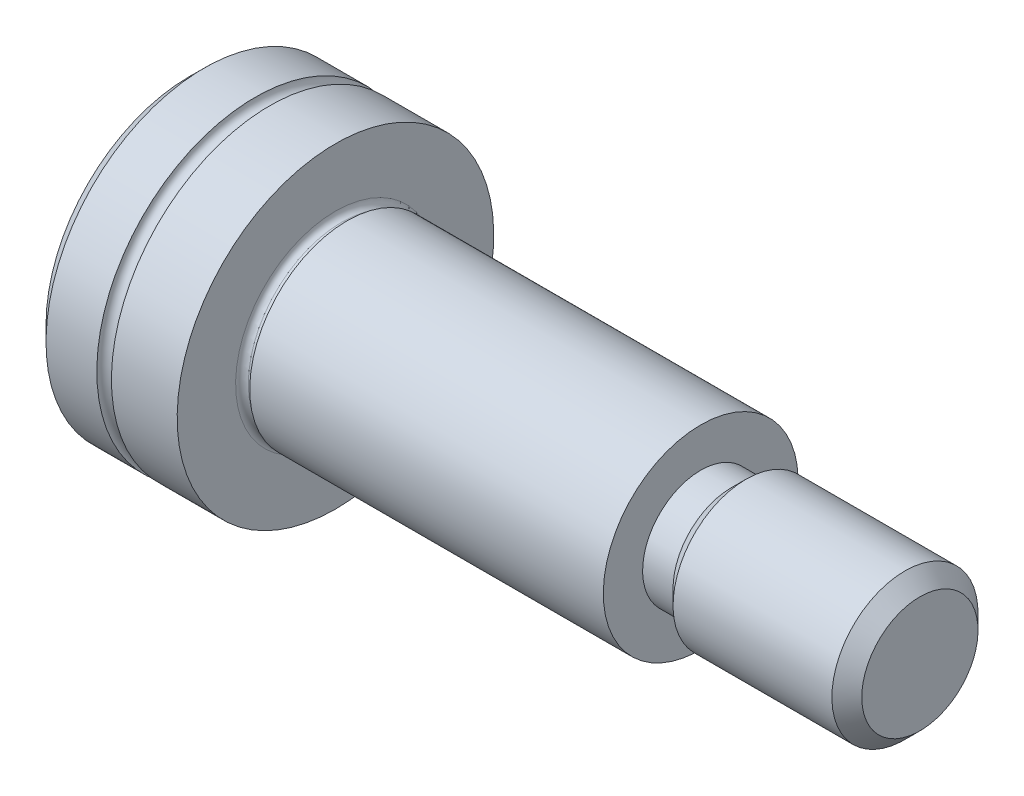
ISO-10303-21;
HEADER;
FILE_DESCRIPTION(('STEP AP214'),'2;1');
FILE_NAME('part.step','',(''),(''),'','','');
FILE_SCHEMA(('AUTOMOTIVE_DESIGN { 1 0 10303 214 1 1 1 1 }'));
ENDSEC;
DATA;
#1=APPLICATION_CONTEXT('core data for automotive mechanical design processes');
#2=APPLICATION_PROTOCOL_DEFINITION('international standard','automotive_design',2000,#1);
#3=PRODUCT_CONTEXT('',#1,'mechanical');
#4=PRODUCT('Part','Part','',(#3));
#5=PRODUCT_RELATED_PRODUCT_CATEGORY('part','',(#4));
#6=PRODUCT_DEFINITION_FORMATION('','',#4);
#7=PRODUCT_DEFINITION_CONTEXT('part definition',#1,'design');
#8=PRODUCT_DEFINITION('design','',#6,#7);
#9=PRODUCT_DEFINITION_SHAPE('','',#8);
#10=(LENGTH_UNIT() NAMED_UNIT(*) SI_UNIT(.MILLI.,.METRE.));
#11=(NAMED_UNIT(*) PLANE_ANGLE_UNIT() SI_UNIT($,.RADIAN.));
#12=(NAMED_UNIT(*) SI_UNIT($,.STERADIAN.) SOLID_ANGLE_UNIT());
#13=UNCERTAINTY_MEASURE_WITH_UNIT(LENGTH_MEASURE(1.E-05),#10,'distance_accuracy_value','');
#14=(GEOMETRIC_REPRESENTATION_CONTEXT(3) GLOBAL_UNCERTAINTY_ASSIGNED_CONTEXT((#13)) GLOBAL_UNIT_ASSIGNED_CONTEXT((#10,
#11,#12)) REPRESENTATION_CONTEXT('',''));
#15=CARTESIAN_POINT('',(0.,0.,0.));
#16=DIRECTION('',(0.,0.,1.));
#17=DIRECTION('',(1.,0.,0.));
#18=AXIS2_PLACEMENT_3D('',#15,#16,#17);
#19=CARTESIAN_POINT('',(0.,0.,0.));
#20=DIRECTION('',(-1.,0.,0.));
#21=DIRECTION('',(0.,-1.,0.));
#22=AXIS2_PLACEMENT_3D('',#19,#20,#21);
#23=CYLINDRICAL_SURFACE('',#22,6.5);
#24=CARTESIAN_POINT('',(0.,0.,0.));
#25=DIRECTION('',(-1.,0.,0.));
#26=DIRECTION('',(0.,-1.,0.));
#27=AXIS2_PLACEMENT_3D('',#24,#25,#26);
#28=CIRCLE('',#27,6.5);
#29=CARTESIAN_POINT('',(0.,-6.5,0.));
#30=VERTEX_POINT('',#29);
#31=EDGE_CURVE('E160',#30,#30,#28,.T.);
#32=ORIENTED_EDGE('',*,*,#31,.T.);
#33=EDGE_LOOP('',(#32));
#34=FACE_BOUND('',#33,.T.);
#35=CARTESIAN_POINT('',(-2.7,0.,0.));
#36=DIRECTION('',(-1.,0.,0.));
#37=DIRECTION('',(0.,-1.,0.));
#38=AXIS2_PLACEMENT_3D('',#35,#36,#37);
#39=CIRCLE('',#38,6.5);
#40=CARTESIAN_POINT('',(-2.7,-6.5,0.));
#41=VERTEX_POINT('',#40);
#42=EDGE_CURVE('E166',#41,#41,#39,.T.);
#43=ORIENTED_EDGE('',*,*,#42,.F.);
#44=EDGE_LOOP('',(#43));
#45=FACE_BOUND('',#44,.T.);
#46=ADVANCED_FACE('F32',(#34,#45),#23,.T.);
#47=CARTESIAN_POINT('',(-3.,0.,0.));
#48=DIRECTION('',(-1.,0.,0.));
#49=DIRECTION('',(0.,-1.,0.));
#50=AXIS2_PLACEMENT_3D('',#47,#48,#49);
#51=TOROIDAL_SURFACE('',#50,6.5,0.299999999999998);
#52=ORIENTED_EDGE('',*,*,#42,.T.);
#53=EDGE_LOOP('',(#52));
#54=FACE_BOUND('',#53,.T.);
#55=CARTESIAN_POINT('',(-3.3,0.,0.));
#56=DIRECTION('',(-1.,0.,0.));
#57=DIRECTION('',(0.,-1.,0.));
#58=AXIS2_PLACEMENT_3D('',#55,#56,#57);
#59=CIRCLE('',#58,6.5);
#60=CARTESIAN_POINT('',(-3.3,-6.5,0.));
#61=VERTEX_POINT('',#60);
#62=EDGE_CURVE('E163',#61,#61,#59,.T.);
#63=ORIENTED_EDGE('',*,*,#62,.F.);
#64=EDGE_LOOP('',(#63));
#65=FACE_BOUND('',#64,.T.);
#66=ADVANCED_FACE('F196',(#54,#65),#51,.F.);
#67=CARTESIAN_POINT('',(0.,0.,0.));
#68=DIRECTION('',(-1.,0.,0.));
#69=DIRECTION('',(0.,-1.,0.));
#70=AXIS2_PLACEMENT_3D('',#67,#68,#69);
#71=CYLINDRICAL_SURFACE('',#70,6.5);
#72=CARTESIAN_POINT('',(-5.38649999999937,0.,0.));
#73=DIRECTION('',(-1.,0.,0.));
#74=DIRECTION('',(0.,-1.,0.));
#75=AXIS2_PLACEMENT_3D('',#72,#73,#74);
#76=CIRCLE('',#75,6.5);
#77=CARTESIAN_POINT('',(-5.38649999999937,-6.5,0.));
#78=VERTEX_POINT('',#77);
#79=EDGE_CURVE('E172',#78,#78,#76,.F.);
#80=ORIENTED_EDGE('',*,*,#79,.T.);
#81=EDGE_LOOP('',(#80));
#82=FACE_BOUND('',#81,.T.);
#83=ORIENTED_EDGE('',*,*,#62,.T.);
#84=EDGE_LOOP('',(#83));
#85=FACE_BOUND('',#84,.T.);
#86=ADVANCED_FACE('F202',(#82,#85),#71,.T.);
#87=CARTESIAN_POINT('',(-6.,0.,0.));
#88=DIRECTION('',(-1.,0.,0.));
#89=DIRECTION('',(0.,-1.,0.));
#90=AXIS2_PLACEMENT_3D('',#87,#88,#89);
#91=PLANE('',#90);
#92=CARTESIAN_POINT('',(-6.,0.,0.));
#93=DIRECTION('',(-1.,0.,0.));
#94=DIRECTION('',(0.,-1.,0.));
#95=AXIS2_PLACEMENT_3D('',#92,#93,#94);
#96=CIRCLE('',#95,5.88649999999938);
#97=CARTESIAN_POINT('',(-6.,-5.88649999999938,0.));
#98=VERTEX_POINT('',#97);
#99=EDGE_CURVE('E169',#98,#98,#96,.T.);
#100=ORIENTED_EDGE('',*,*,#99,.T.);
#101=EDGE_LOOP('',(#100));
#102=FACE_BOUND('',#101,.T.);
#103=DIRECTION('',(0.,0.500000000000001,0.866025403784438));
#104=VECTOR('',#103,1.);
#105=CARTESIAN_POINT('',(-6.,-2.88675134594813,0.));
#106=LINE('',#105,#104);
#107=CARTESIAN_POINT('',(-6.,-2.88675134594813,0.));
#108=VERTEX_POINT('',#107);
#109=CARTESIAN_POINT('',(-6.,-1.44337567297406,2.5));
#110=VERTEX_POINT('',#109);
#111=EDGE_CURVE('E47',#108,#110,#106,.T.);
#112=ORIENTED_EDGE('',*,*,#111,.F.);
#113=DIRECTION('',(0.,-0.500000000000001,0.866025403784438));
#114=VECTOR('',#113,1.);
#115=CARTESIAN_POINT('',(-6.,-1.44337567297406,-2.5));
#116=LINE('',#115,#114);
#117=CARTESIAN_POINT('',(-6.,-1.44337567297406,-2.5));
#118=VERTEX_POINT('',#117);
#119=EDGE_CURVE('E133',#118,#108,#116,.T.);
#120=ORIENTED_EDGE('',*,*,#119,.F.);
#121=DIRECTION('',(0.,-1.,0.));
#122=VECTOR('',#121,1.);
#123=CARTESIAN_POINT('',(-6.,1.44337567297406,-2.5));
#124=LINE('',#123,#122);
#125=CARTESIAN_POINT('',(-6.,1.44337567297406,-2.5));
#126=VERTEX_POINT('',#125);
#127=EDGE_CURVE('E131',#126,#118,#124,.T.);
#128=ORIENTED_EDGE('',*,*,#127,.F.);
#129=DIRECTION('',(0.,-0.500000000000001,-0.866025403784438));
#130=VECTOR('',#129,1.);
#131=CARTESIAN_POINT('',(-6.,2.88675134594813,0.));
#132=LINE('',#131,#130);
#133=CARTESIAN_POINT('',(-6.,2.88675134594813,0.));
#134=VERTEX_POINT('',#133);
#135=EDGE_CURVE('E97',#134,#126,#132,.T.);
#136=ORIENTED_EDGE('',*,*,#135,.F.);
#137=DIRECTION('',(0.,0.5,-0.866025403784438));
#138=VECTOR('',#137,1.);
#139=CARTESIAN_POINT('',(-6.,1.44337567297406,2.5));
#140=LINE('',#139,#138);
#141=CARTESIAN_POINT('',(-6.,1.44337567297406,2.5));
#142=VERTEX_POINT('',#141);
#143=EDGE_CURVE('E127',#142,#134,#140,.T.);
#144=ORIENTED_EDGE('',*,*,#143,.F.);
#145=DIRECTION('',(0.,1.,0.));
#146=VECTOR('',#145,1.);
#147=CARTESIAN_POINT('',(-6.,-1.44337567297406,2.5));
#148=LINE('',#147,#146);
#149=EDGE_CURVE('E123',#110,#142,#148,.T.);
#150=ORIENTED_EDGE('',*,*,#149,.F.);
#151=EDGE_LOOP('',(#112,#120,#128,#136,#144,#150));
#152=FACE_BOUND('',#151,.T.);
#153=ADVANCED_FACE('F220',(#102,#152),#91,.T.);
#154=CARTESIAN_POINT('',(0.,6.5,0.));
#155=DIRECTION('',(1.,0.,0.));
#156=DIRECTION('',(0.,1.,0.));
#157=AXIS2_PLACEMENT_3D('',#154,#155,#156);
#158=PLANE('',#157);
#159=CARTESIAN_POINT('',(0.,0.,0.));
#160=DIRECTION('',(1.,0.,0.));
#161=DIRECTION('',(0.,1.,0.));
#162=AXIS2_PLACEMENT_3D('',#159,#160,#161);
#163=CIRCLE('',#162,4.101);
#164=CARTESIAN_POINT('',(0.,4.101,0.));
#165=VERTEX_POINT('',#164);
#166=EDGE_CURVE('E11',#165,#165,#163,.F.);
#167=ORIENTED_EDGE('',*,*,#166,.T.);
#168=EDGE_LOOP('',(#167));
#169=FACE_BOUND('',#168,.T.);
#170=ORIENTED_EDGE('',*,*,#31,.F.);
#171=EDGE_LOOP('',(#170));
#172=FACE_BOUND('',#171,.T.);
#173=ADVANCED_FACE('F223',(#169,#172),#158,.T.);
#174=CARTESIAN_POINT('',(0.387623956896732,0.,0.));
#175=DIRECTION('',(-1.,0.,0.));
#176=DIRECTION('',(0.,-1.,0.));
#177=AXIS2_PLACEMENT_3D('',#174,#175,#176);
#178=CYLINDRICAL_SURFACE('',#177,3.84);
#179=CARTESIAN_POINT('',(0.261000000000001,0.,0.));
#180=DIRECTION('',(1.,0.,0.));
#181=DIRECTION('',(0.,1.,0.));
#182=AXIS2_PLACEMENT_3D('',#179,#180,#181);
#183=CIRCLE('',#182,3.84);
#184=CARTESIAN_POINT('',(0.261000000000001,3.84,0.));
#185=VERTEX_POINT('',#184);
#186=EDGE_CURVE('E40',#185,#185,#183,.T.);
#187=ORIENTED_EDGE('',*,*,#186,.T.);
#188=EDGE_LOOP('',(#187));
#189=FACE_BOUND('',#188,.T.);
#190=CARTESIAN_POINT('',(0.387623956896732,0.,0.));
#191=DIRECTION('',(1.,0.,0.));
#192=DIRECTION('',(0.,1.,0.));
#193=AXIS2_PLACEMENT_3D('',#190,#191,#192);
#194=CIRCLE('',#193,3.84);
#195=CARTESIAN_POINT('',(0.387623956896732,3.84,0.));
#196=VERTEX_POINT('',#195);
#197=EDGE_CURVE('E157',#196,#196,#194,.T.);
#198=ORIENTED_EDGE('',*,*,#197,.F.);
#199=EDGE_LOOP('',(#198));
#200=FACE_BOUND('',#199,.T.);
#201=ADVANCED_FACE('F183',(#189,#200),#178,.T.);
#202=CARTESIAN_POINT('',(0.387623956896732,0.,0.));
#203=DIRECTION('',(1.,0.,0.));
#204=DIRECTION('',(0.,1.,0.));
#205=AXIS2_PLACEMENT_3D('',#202,#203,#204);
#206=CONICAL_SURFACE('',#205,3.83999999999469,1.04719755126488);
#207=CARTESIAN_POINT('',(0.480000000000001,0.,0.));
#208=DIRECTION('',(1.,0.,0.));
#209=DIRECTION('',(0.,1.,0.));
#210=AXIS2_PLACEMENT_3D('',#207,#208,#209);
#211=CIRCLE('',#210,4.00000000007696);
#212=CARTESIAN_POINT('',(0.480000000000001,4.00000000007696,0.));
#213=VERTEX_POINT('',#212);
#214=EDGE_CURVE('E154',#213,#213,#211,.T.);
#215=ORIENTED_EDGE('',*,*,#214,.F.);
#216=EDGE_LOOP('',(#215));
#217=FACE_BOUND('',#216,.T.);
#218=ORIENTED_EDGE('',*,*,#197,.T.);
#219=EDGE_LOOP('',(#218));
#220=FACE_BOUND('',#219,.T.);
#221=ADVANCED_FACE('F281',(#217,#220),#206,.T.);
#222=CARTESIAN_POINT('',(15.,0.,0.));
#223=DIRECTION('',(-1.,0.,0.));
#224=DIRECTION('',(0.,-1.,0.));
#225=AXIS2_PLACEMENT_3D('',#222,#223,#224);
#226=CYLINDRICAL_SURFACE('',#225,4.);
#227=CARTESIAN_POINT('',(15.,0.,0.));
#228=DIRECTION('',(1.,0.,0.));
#229=DIRECTION('',(0.,1.,0.));
#230=AXIS2_PLACEMENT_3D('',#227,#228,#229);
#231=CIRCLE('',#230,4.);
#232=CARTESIAN_POINT('',(15.,4.,0.));
#233=VERTEX_POINT('',#232);
#234=EDGE_CURVE('E149',#233,#233,#231,.T.);
#235=ORIENTED_EDGE('',*,*,#234,.F.);
#236=EDGE_LOOP('',(#235));
#237=FACE_BOUND('',#236,.T.);
#238=ORIENTED_EDGE('',*,*,#214,.T.);
#239=EDGE_LOOP('',(#238));
#240=FACE_BOUND('',#239,.T.);
#241=ADVANCED_FACE('F277',(#237,#240),#226,.T.);
#242=CARTESIAN_POINT('',(15.,0.,0.));
#243=DIRECTION('',(1.,0.,0.));
#244=DIRECTION('',(0.,1.,0.));
#245=AXIS2_PLACEMENT_3D('',#242,#243,#244);
#246=PLANE('',#245);
#247=CARTESIAN_POINT('',(15.,0.,0.));
#248=DIRECTION('',(1.,0.,0.));
#249=DIRECTION('',(0.,1.,0.));
#250=AXIS2_PLACEMENT_3D('',#247,#248,#249);
#251=CIRCLE('',#250,2.3865);
#252=CARTESIAN_POINT('',(15.,2.3865,0.));
#253=VERTEX_POINT('',#252);
#254=EDGE_CURVE('E145',#253,#253,#251,.T.);
#255=ORIENTED_EDGE('',*,*,#254,.F.);
#256=EDGE_LOOP('',(#255));
#257=FACE_BOUND('',#256,.T.);
#258=ORIENTED_EDGE('',*,*,#234,.T.);
#259=EDGE_LOOP('',(#258));
#260=FACE_BOUND('',#259,.T.);
#261=ADVANCED_FACE('F273',(#257,#260),#246,.T.);
#262=CARTESIAN_POINT('',(16.25,0.,0.));
#263=DIRECTION('',(-1.,0.,0.));
#264=DIRECTION('',(0.,-1.,0.));
#265=AXIS2_PLACEMENT_3D('',#262,#263,#264);
#266=CYLINDRICAL_SURFACE('',#265,2.3865);
#267=CARTESIAN_POINT('',(16.25,0.,0.));
#268=DIRECTION('',(1.,0.,0.));
#269=DIRECTION('',(0.,1.,0.));
#270=AXIS2_PLACEMENT_3D('',#267,#268,#269);
#271=CIRCLE('',#270,2.3865);
#272=CARTESIAN_POINT('',(16.25,2.3865,0.));
#273=VERTEX_POINT('',#272);
#274=EDGE_CURVE('E146',#273,#273,#271,.T.);
#275=ORIENTED_EDGE('',*,*,#274,.F.);
#276=EDGE_LOOP('',(#275));
#277=FACE_BOUND('',#276,.T.);
#278=ORIENTED_EDGE('',*,*,#254,.T.);
#279=EDGE_LOOP('',(#278));
#280=FACE_BOUND('',#279,.T.);
#281=ADVANCED_FACE('F269',(#277,#280),#266,.T.);
#282=CARTESIAN_POINT('',(16.25,0.,0.));
#283=DIRECTION('',(1.,0.,0.));
#284=DIRECTION('',(0.,1.,0.));
#285=AXIS2_PLACEMENT_3D('',#282,#283,#284);
#286=CONICAL_SURFACE('',#285,2.38649999998643,0.785398163397452);
#287=CARTESIAN_POINT('',(16.8634999999995,0.,0.));
#288=DIRECTION('',(1.,0.,0.));
#289=DIRECTION('',(0.,1.,0.));
#290=AXIS2_PLACEMENT_3D('',#287,#288,#289);
#291=CIRCLE('',#290,2.99999999998591);
#292=CARTESIAN_POINT('',(16.8634999999995,2.99999999998591,0.));
#293=VERTEX_POINT('',#292);
#294=EDGE_CURVE('E137',#293,#293,#291,.T.);
#295=ORIENTED_EDGE('',*,*,#294,.F.);
#296=EDGE_LOOP('',(#295));
#297=FACE_BOUND('',#296,.T.);
#298=ORIENTED_EDGE('',*,*,#274,.T.);
#299=EDGE_LOOP('',(#298));
#300=FACE_BOUND('',#299,.T.);
#301=ADVANCED_FACE('F265',(#297,#300),#286,.T.);
#302=CARTESIAN_POINT('',(24.,0.,0.));
#303=DIRECTION('',(-1.,0.,0.));
#304=DIRECTION('',(0.,-1.,0.));
#305=AXIS2_PLACEMENT_3D('',#302,#303,#304);
#306=CYLINDRICAL_SURFACE('',#305,3.);
#307=CARTESIAN_POINT('',(23.3864999999994,0.,0.));
#308=DIRECTION('',(1.,0.,0.));
#309=DIRECTION('',(0.,1.,0.));
#310=AXIS2_PLACEMENT_3D('',#307,#308,#309);
#311=CIRCLE('',#310,3.);
#312=CARTESIAN_POINT('',(23.3864999999994,3.,0.));
#313=VERTEX_POINT('',#312);
#314=EDGE_CURVE('E178',#313,#313,#311,.F.);
#315=ORIENTED_EDGE('',*,*,#314,.T.);
#316=EDGE_LOOP('',(#315));
#317=FACE_BOUND('',#316,.T.);
#318=ORIENTED_EDGE('',*,*,#294,.T.);
#319=EDGE_LOOP('',(#318));
#320=FACE_BOUND('',#319,.T.);
#321=ADVANCED_FACE('F261',(#317,#320),#306,.T.);
#322=CARTESIAN_POINT('',(24.,0.,0.));
#323=DIRECTION('',(1.,0.,0.));
#324=DIRECTION('',(0.,1.,0.));
#325=AXIS2_PLACEMENT_3D('',#322,#323,#324);
#326=PLANE('',#325);
#327=CARTESIAN_POINT('',(24.,0.,0.));
#328=DIRECTION('',(1.,0.,0.));
#329=DIRECTION('',(0.,1.,0.));
#330=AXIS2_PLACEMENT_3D('',#327,#328,#329);
#331=CIRCLE('',#330,2.38649999999938);
#332=CARTESIAN_POINT('',(24.,2.38649999999938,0.));
#333=VERTEX_POINT('',#332);
#334=EDGE_CURVE('E175',#333,#333,#331,.T.);
#335=ORIENTED_EDGE('',*,*,#334,.T.);
#336=EDGE_LOOP('',(#335));
#337=FACE_BOUND('',#336,.T.);
#338=ADVANCED_FACE('F258',(#337),#326,.T.);
#339=CARTESIAN_POINT('',(-3.,-2.88675134594813,0.));
#340=DIRECTION('',(0.,-0.866025403784438,0.500000000000001));
#341=DIRECTION('',(0.,-0.500000000000001,-0.866025403784438));
#342=AXIS2_PLACEMENT_3D('',#339,#340,#341);
#343=PLANE('',#342);
#344=ORIENTED_EDGE('',*,*,#111,.T.);
#345=DIRECTION('',(-1.,0.,0.));
#346=VECTOR('',#345,1.);
#347=CARTESIAN_POINT('',(-3.,-1.44337567297406,2.5));
#348=LINE('',#347,#346);
#349=CARTESIAN_POINT('',(-3.,-1.44337567297406,2.5));
#350=VERTEX_POINT('',#349);
#351=EDGE_CURVE('E78',#350,#110,#348,.T.);
#352=ORIENTED_EDGE('',*,*,#351,.F.);
#353=DIRECTION('',(0.,0.500000000000001,0.866025403784438));
#354=VECTOR('',#353,1.);
#355=CARTESIAN_POINT('',(-3.,-2.88675134594813,0.));
#356=LINE('',#355,#354);
#357=CARTESIAN_POINT('',(-3.,-2.88675134594813,0.));
#358=VERTEX_POINT('',#357);
#359=EDGE_CURVE('E135',#358,#350,#356,.T.);
#360=ORIENTED_EDGE('',*,*,#359,.F.);
#361=DIRECTION('',(-1.,0.,0.));
#362=VECTOR('',#361,1.);
#363=CARTESIAN_POINT('',(-3.,-2.88675134594813,0.));
#364=LINE('',#363,#362);
#365=EDGE_CURVE('E55',#358,#108,#364,.T.);
#366=ORIENTED_EDGE('',*,*,#365,.T.);
#367=EDGE_LOOP('',(#344,#352,#360,#366));
#368=FACE_BOUND('',#367,.T.);
#369=ADVANCED_FACE('F248',(#368),#343,.F.);
#370=CARTESIAN_POINT('',(-3.,-1.44337567297406,-2.5));
#371=DIRECTION('',(0.,-0.866025403784438,-0.500000000000001));
#372=DIRECTION('',(0.,0.500000000000001,-0.866025403784438));
#373=AXIS2_PLACEMENT_3D('',#370,#371,#372);
#374=PLANE('',#373);
#375=ORIENTED_EDGE('',*,*,#119,.T.);
#376=ORIENTED_EDGE('',*,*,#365,.F.);
#377=DIRECTION('',(0.,-0.500000000000001,0.866025403784438));
#378=VECTOR('',#377,1.);
#379=CARTESIAN_POINT('',(-3.,-1.44337567297406,-2.5));
#380=LINE('',#379,#378);
#381=CARTESIAN_POINT('',(-3.,-1.44337567297406,-2.5));
#382=VERTEX_POINT('',#381);
#383=EDGE_CURVE('E109',#382,#358,#380,.T.);
#384=ORIENTED_EDGE('',*,*,#383,.F.);
#385=DIRECTION('',(-1.,0.,0.));
#386=VECTOR('',#385,1.);
#387=CARTESIAN_POINT('',(-3.,-1.44337567297406,-2.5));
#388=LINE('',#387,#386);
#389=EDGE_CURVE('E101',#382,#118,#388,.T.);
#390=ORIENTED_EDGE('',*,*,#389,.T.);
#391=EDGE_LOOP('',(#375,#376,#384,#390));
#392=FACE_BOUND('',#391,.T.);
#393=ADVANCED_FACE('F245',(#392),#374,.F.);
#394=CARTESIAN_POINT('',(-3.,1.44337567297406,-2.5));
#395=DIRECTION('',(0.,0.,-1.));
#396=DIRECTION('',(0.,1.,0.));
#397=AXIS2_PLACEMENT_3D('',#394,#395,#396);
#398=PLANE('',#397);
#399=ORIENTED_EDGE('',*,*,#127,.T.);
#400=ORIENTED_EDGE('',*,*,#389,.F.);
#401=DIRECTION('',(0.,-1.,0.));
#402=VECTOR('',#401,1.);
#403=CARTESIAN_POINT('',(-3.,1.44337567297406,-2.5));
#404=LINE('',#403,#402);
#405=CARTESIAN_POINT('',(-3.,1.44337567297406,-2.5));
#406=VERTEX_POINT('',#405);
#407=EDGE_CURVE('E105',#406,#382,#404,.T.);
#408=ORIENTED_EDGE('',*,*,#407,.F.);
#409=DIRECTION('',(-1.,0.,0.));
#410=VECTOR('',#409,1.);
#411=CARTESIAN_POINT('',(-3.,1.44337567297406,-2.5));
#412=LINE('',#411,#410);
#413=EDGE_CURVE('E90',#406,#126,#412,.T.);
#414=ORIENTED_EDGE('',*,*,#413,.T.);
#415=EDGE_LOOP('',(#399,#400,#408,#414));
#416=FACE_BOUND('',#415,.T.);
#417=ADVANCED_FACE('F106',(#416),#398,.F.);
#418=CARTESIAN_POINT('',(-3.,2.88675134594813,0.));
#419=DIRECTION('',(0.,0.866025403784438,-0.500000000000001));
#420=DIRECTION('',(0.,0.500000000000001,0.866025403784438));
#421=AXIS2_PLACEMENT_3D('',#418,#419,#420);
#422=PLANE('',#421);
#423=ORIENTED_EDGE('',*,*,#135,.T.);
#424=ORIENTED_EDGE('',*,*,#413,.F.);
#425=DIRECTION('',(0.,-0.500000000000001,-0.866025403784438));
#426=VECTOR('',#425,1.);
#427=CARTESIAN_POINT('',(-3.,2.88675134594813,0.));
#428=LINE('',#427,#426);
#429=CARTESIAN_POINT('',(-3.,2.88675134594813,0.));
#430=VERTEX_POINT('',#429);
#431=EDGE_CURVE('E94',#430,#406,#428,.T.);
#432=ORIENTED_EDGE('',*,*,#431,.F.);
#433=DIRECTION('',(-1.,0.,0.));
#434=VECTOR('',#433,1.);
#435=CARTESIAN_POINT('',(-3.,2.88675134594813,0.));
#436=LINE('',#435,#434);
#437=EDGE_CURVE('E102',#430,#134,#436,.T.);
#438=ORIENTED_EDGE('',*,*,#437,.T.);
#439=EDGE_LOOP('',(#423,#424,#432,#438));
#440=FACE_BOUND('',#439,.T.);
#441=ADVANCED_FACE('F92',(#440),#422,.F.);
#442=CARTESIAN_POINT('',(-3.,1.44337567297406,2.5));
#443=DIRECTION('',(0.,0.866025403784438,0.500000000000001));
#444=DIRECTION('',(0.,-0.500000000000001,0.866025403784438));
#445=AXIS2_PLACEMENT_3D('',#442,#443,#444);
#446=PLANE('',#445);
#447=ORIENTED_EDGE('',*,*,#143,.T.);
#448=ORIENTED_EDGE('',*,*,#437,.F.);
#449=DIRECTION('',(0.,0.5,-0.866025403784438));
#450=VECTOR('',#449,1.);
#451=CARTESIAN_POINT('',(-3.,1.44337567297406,2.5));
#452=LINE('',#451,#450);
#453=CARTESIAN_POINT('',(-3.,1.44337567297406,2.5));
#454=VERTEX_POINT('',#453);
#455=EDGE_CURVE('E115',#454,#430,#452,.T.);
#456=ORIENTED_EDGE('',*,*,#455,.F.);
#457=DIRECTION('',(-1.,0.,0.));
#458=VECTOR('',#457,1.);
#459=CARTESIAN_POINT('',(-3.,1.44337567297406,2.5));
#460=LINE('',#459,#458);
#461=EDGE_CURVE('E140',#454,#142,#460,.T.);
#462=ORIENTED_EDGE('',*,*,#461,.T.);
#463=EDGE_LOOP('',(#447,#448,#456,#462));
#464=FACE_BOUND('',#463,.T.);
#465=ADVANCED_FACE('F242',(#464),#446,.F.);
#466=CARTESIAN_POINT('',(-3.,-1.44337567297406,2.5));
#467=DIRECTION('',(0.,0.,1.));
#468=DIRECTION('',(0.,-1.,0.));
#469=AXIS2_PLACEMENT_3D('',#466,#467,#468);
#470=PLANE('',#469);
#471=ORIENTED_EDGE('',*,*,#149,.T.);
#472=ORIENTED_EDGE('',*,*,#461,.F.);
#473=DIRECTION('',(0.,1.,0.));
#474=VECTOR('',#473,1.);
#475=CARTESIAN_POINT('',(-3.,-1.44337567297406,2.5));
#476=LINE('',#475,#474);
#477=EDGE_CURVE('E117',#350,#454,#476,.T.);
#478=ORIENTED_EDGE('',*,*,#477,.F.);
#479=ORIENTED_EDGE('',*,*,#351,.T.);
#480=EDGE_LOOP('',(#471,#472,#478,#479));
#481=FACE_BOUND('',#480,.T.);
#482=ADVANCED_FACE('F229',(#481),#470,.F.);
#483=CARTESIAN_POINT('',(-3.,0.,0.));
#484=DIRECTION('',(-1.,0.,0.));
#485=DIRECTION('',(0.,0.,1.));
#486=AXIS2_PLACEMENT_3D('',#483,#484,#485);
#487=PLANE('',#486);
#488=CARTESIAN_POINT('',(-3.00000000000195,0.,0.));
#489=DIRECTION('',(1.,0.,0.));
#490=DIRECTION('',(0.,0.,-1.));
#491=AXIS2_PLACEMENT_3D('',#488,#489,#490);
#492=CIRCLE('',#491,2.39999999999885);
#493=CARTESIAN_POINT('',(-3.00000000000195,0.,-2.39999999999885));
#494=VERTEX_POINT('',#493);
#495=EDGE_CURVE('E124',#494,#494,#492,.T.);
#496=ORIENTED_EDGE('',*,*,#495,.T.);
#497=EDGE_LOOP('',(#496));
#498=FACE_BOUND('',#497,.T.);
#499=ORIENTED_EDGE('',*,*,#359,.T.);
#500=ORIENTED_EDGE('',*,*,#477,.T.);
#501=ORIENTED_EDGE('',*,*,#455,.T.);
#502=ORIENTED_EDGE('',*,*,#431,.T.);
#503=ORIENTED_EDGE('',*,*,#407,.T.);
#504=ORIENTED_EDGE('',*,*,#383,.T.);
#505=EDGE_LOOP('',(#499,#500,#501,#502,#503,#504));
#506=FACE_BOUND('',#505,.T.);
#507=ADVANCED_FACE('F112',(#498,#506),#487,.T.);
#508=CARTESIAN_POINT('',(-1.61435935394749,0.,0.));
#509=DIRECTION('',(-1.,0.,0.));
#510=DIRECTION('',(0.,0.,1.));
#511=AXIS2_PLACEMENT_3D('',#508,#509,#510);
#512=CONICAL_SURFACE('',#511,0.,1.04719755119659);
#513=ORIENTED_EDGE('',*,*,#495,.F.);
#514=EDGE_LOOP('',(#513));
#515=FACE_BOUND('',#514,.T.);
#516=CARTESIAN_POINT('',(-1.61435935394749,0.,0.));
#517=VERTEX_POINT('',#516);
#518=VERTEX_LOOP('',#517);
#519=FACE_BOUND('',#518,.T.);
#520=ADVANCED_FACE('F209',(#515,#519),#512,.F.);
#521=CARTESIAN_POINT('',(-6.,0.,0.));
#522=DIRECTION('',(1.,0.,0.));
#523=DIRECTION('',(0.,1.,0.));
#524=AXIS2_PLACEMENT_3D('',#521,#522,#523);
#525=CONICAL_SURFACE('',#524,5.88649999999938,0.785398163397443);
#526=ORIENTED_EDGE('',*,*,#79,.F.);
#527=EDGE_LOOP('',(#526));
#528=FACE_BOUND('',#527,.T.);
#529=ORIENTED_EDGE('',*,*,#99,.F.);
#530=EDGE_LOOP('',(#529));
#531=FACE_BOUND('',#530,.T.);
#532=ADVANCED_FACE('F192',(#528,#531),#525,.T.);
#533=CARTESIAN_POINT('',(24.,0.,0.));
#534=DIRECTION('',(-1.,0.,0.));
#535=DIRECTION('',(0.,-1.,0.));
#536=AXIS2_PLACEMENT_3D('',#533,#534,#535);
#537=CONICAL_SURFACE('',#536,2.38649999999938,0.785398163397446);
#538=ORIENTED_EDGE('',*,*,#314,.F.);
#539=EDGE_LOOP('',(#538));
#540=FACE_BOUND('',#539,.T.);
#541=ORIENTED_EDGE('',*,*,#334,.F.);
#542=EDGE_LOOP('',(#541));
#543=FACE_BOUND('',#542,.T.);
#544=ADVANCED_FACE('F187',(#540,#543),#537,.T.);
#545=CARTESIAN_POINT('',(0.261000000000001,0.,0.));
#546=DIRECTION('',(1.,0.,0.));
#547=DIRECTION('',(0.,1.,0.));
#548=AXIS2_PLACEMENT_3D('',#545,#546,#547);
#549=TOROIDAL_SURFACE('',#548,4.101,0.261000000000001);
#550=ORIENTED_EDGE('',*,*,#166,.F.);
#551=EDGE_LOOP('',(#550));
#552=FACE_BOUND('',#551,.T.);
#553=ORIENTED_EDGE('',*,*,#186,.F.);
#554=EDGE_LOOP('',(#553));
#555=FACE_BOUND('',#554,.T.);
#556=ADVANCED_FACE('F34',(#552,#555),#549,.F.);
#557=CLOSED_SHELL('',(#46,#66,#86,#153,#173,#201,#221,#241,#261,#281,#301,#321,#338,#369,#393,
#417,#441,#465,#482,#507,#520,#532,#544,#556));
#558=MANIFOLD_SOLID_BREP('B2',#557);
#559=ADVANCED_BREP_SHAPE_REPRESENTATION('',(#18,#558),#14);
#560=SHAPE_DEFINITION_REPRESENTATION(#9,#559);
ENDSEC;
END-ISO-10303-21;
